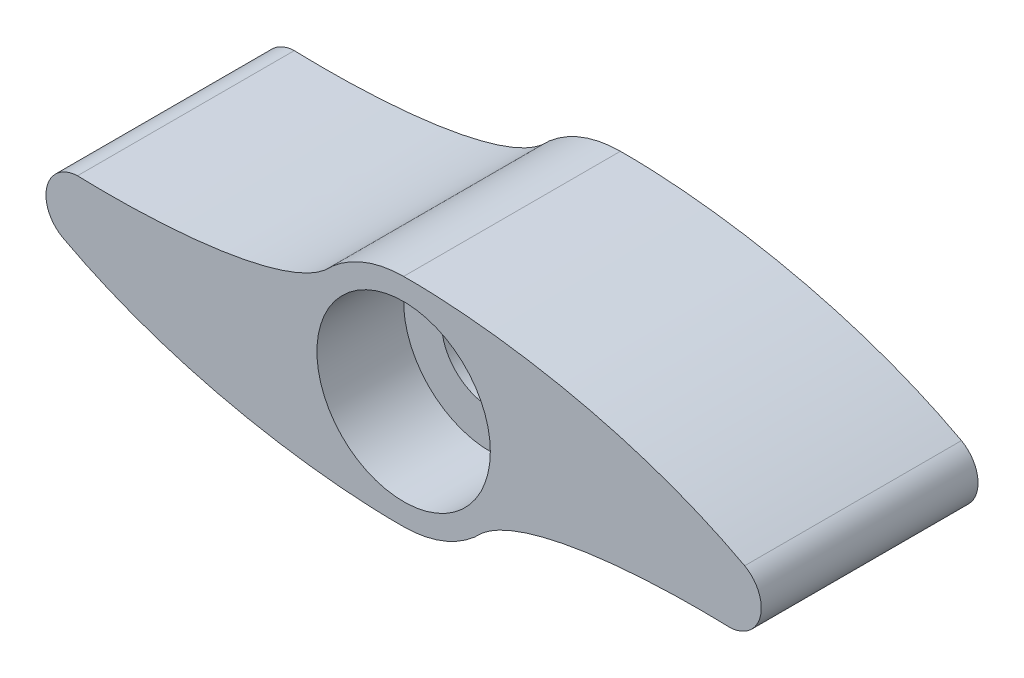
ISO-10303-21;
HEADER;
FILE_DESCRIPTION(('STEP AP214'),'2;1');
FILE_NAME('part.step','',(''),(''),'','','');
FILE_SCHEMA(('AUTOMOTIVE_DESIGN { 1 0 10303 214 1 1 1 1 }'));
ENDSEC;
DATA;
#1=APPLICATION_CONTEXT('core data for automotive mechanical design processes');
#2=APPLICATION_PROTOCOL_DEFINITION('international standard','automotive_design',2000,#1);
#3=PRODUCT_CONTEXT('',#1,'mechanical');
#4=PRODUCT('Part','Part','',(#3));
#5=PRODUCT_RELATED_PRODUCT_CATEGORY('part','',(#4));
#6=PRODUCT_DEFINITION_FORMATION('','',#4);
#7=PRODUCT_DEFINITION_CONTEXT('part definition',#1,'design');
#8=PRODUCT_DEFINITION('design','',#6,#7);
#9=PRODUCT_DEFINITION_SHAPE('','',#8);
#10=(LENGTH_UNIT() NAMED_UNIT(*) SI_UNIT(.MILLI.,.METRE.));
#11=(NAMED_UNIT(*) PLANE_ANGLE_UNIT() SI_UNIT($,.RADIAN.));
#12=(NAMED_UNIT(*) SI_UNIT($,.STERADIAN.) SOLID_ANGLE_UNIT());
#13=UNCERTAINTY_MEASURE_WITH_UNIT(LENGTH_MEASURE(1.E-05),#10,'distance_accuracy_value','');
#14=(GEOMETRIC_REPRESENTATION_CONTEXT(3) GLOBAL_UNCERTAINTY_ASSIGNED_CONTEXT((#13)) GLOBAL_UNIT_ASSIGNED_CONTEXT((#10,
#11,#12)) REPRESENTATION_CONTEXT('',''));
#15=CARTESIAN_POINT('',(0.,0.,0.));
#16=DIRECTION('',(0.,0.,1.));
#17=DIRECTION('',(1.,0.,0.));
#18=AXIS2_PLACEMENT_3D('',#15,#16,#17);
#19=CARTESIAN_POINT('',(-6.98119583788465,-4.30444399980492,10.));
#20=DIRECTION('',(0.,0.,-1.));
#21=DIRECTION('',(-1.,0.,0.));
#22=AXIS2_PLACEMENT_3D('',#19,#20,#21);
#23=PLANE('',#22);
#24=CARTESIAN_POINT('',(-15.7344248673067,-1.30790676819165,10.));
#25=CARTESIAN_POINT('',(-10.0867938176435,-4.33966719943678,10.));
#26=CARTESIAN_POINT('',(-3.28492012761338,-5.03621454397914,10.));
#27=CARTESIAN_POINT('',(0.,-5.,10.));
#28=B_SPLINE_CURVE_WITH_KNOTS('',3,(#24,#25,#26,#27),.UNSPECIFIED.,.F.,.F.,(4,4),(0.,1.),.UNSPECIFIED.);
#29=CARTESIAN_POINT('',(-15.7344248673067,-1.30790676819165,10.));
#30=VERTEX_POINT('',#29);
#31=CARTESIAN_POINT('',(0.,-5.,10.));
#32=VERTEX_POINT('',#31);
#33=EDGE_CURVE('E238',#30,#32,#28,.T.);
#34=ORIENTED_EDGE('',*,*,#33,.T.);
#35=CARTESIAN_POINT('',(0.,0.,10.));
#36=DIRECTION('',(0.,0.,1.));
#37=DIRECTION('',(1.,0.,0.));
#38=AXIS2_PLACEMENT_3D('',#35,#36,#37);
#39=CIRCLE('',#38,5.);
#40=CARTESIAN_POINT('',(3.6325228067604,-3.43580821035831,10.));
#41=VERTEX_POINT('',#40);
#42=EDGE_CURVE('E96',#32,#41,#39,.T.);
#43=ORIENTED_EDGE('',*,*,#42,.T.);
#44=CARTESIAN_POINT('',(3.6325228067604,-3.43580821035831,10.));
#45=CARTESIAN_POINT('',(5.45932540377512,-1.90210600197204,10.));
#46=CARTESIAN_POINT('',(10.3946412726031,-1.35543382633431,10.));
#47=CARTESIAN_POINT('',(15.0441418943268,-1.49935035704309,10.));
#48=B_SPLINE_CURVE_WITH_KNOTS('',3,(#44,#45,#46,#47),.UNSPECIFIED.,.F.,.F.,(4,4),(0.,1.),.UNSPECIFIED.);
#49=CARTESIAN_POINT('',(15.0441418943268,-1.4993503570431,10.));
#50=VERTEX_POINT('',#49);
#51=EDGE_CURVE('E162',#41,#50,#48,.T.);
#52=ORIENTED_EDGE('',*,*,#51,.T.);
#53=CARTESIAN_POINT('',(15.,0.,10.));
#54=DIRECTION('',(0.,0.,1.));
#55=DIRECTION('',(1.,0.,0.));
#56=AXIS2_PLACEMENT_3D('',#53,#54,#55);
#57=CIRCLE('',#56,1.5);
#58=CARTESIAN_POINT('',(15.7344248673067,1.30790676819165,10.));
#59=VERTEX_POINT('',#58);
#60=EDGE_CURVE('E157',#50,#59,#57,.T.);
#61=ORIENTED_EDGE('',*,*,#60,.T.);
#62=CARTESIAN_POINT('',(15.7344248673067,1.30790676819165,10.));
#63=CARTESIAN_POINT('',(10.0867938176435,4.33966719943678,10.));
#64=CARTESIAN_POINT('',(3.28492012761338,5.03621454397913,10.));
#65=CARTESIAN_POINT('',(0.,5.,10.));
#66=B_SPLINE_CURVE_WITH_KNOTS('',3,(#62,#63,#64,#65),.UNSPECIFIED.,.F.,.F.,(4,4),(0.,1.),.UNSPECIFIED.);
#67=CARTESIAN_POINT('',(0.,5.,10.));
#68=VERTEX_POINT('',#67);
#69=EDGE_CURVE('E115',#59,#68,#66,.T.);
#70=ORIENTED_EDGE('',*,*,#69,.T.);
#71=CARTESIAN_POINT('',(0.,0.,10.));
#72=DIRECTION('',(0.,0.,1.));
#73=DIRECTION('',(1.,0.,0.));
#74=AXIS2_PLACEMENT_3D('',#71,#72,#73);
#75=CIRCLE('',#74,5.);
#76=CARTESIAN_POINT('',(-3.6325228067604,3.43580821035831,10.));
#77=VERTEX_POINT('',#76);
#78=EDGE_CURVE('E109',#68,#77,#75,.T.);
#79=ORIENTED_EDGE('',*,*,#78,.T.);
#80=CARTESIAN_POINT('',(-3.6325228067604,3.43580821035831,10.));
#81=CARTESIAN_POINT('',(-5.45932540377512,1.90210600197204,10.));
#82=CARTESIAN_POINT('',(-10.3946412726031,1.35543382633431,10.));
#83=CARTESIAN_POINT('',(-15.0441418943268,1.49935035704309,10.));
#84=B_SPLINE_CURVE_WITH_KNOTS('',3,(#80,#81,#82,#83),.UNSPECIFIED.,.F.,.F.,(4,4),(0.,1.),.UNSPECIFIED.);
#85=CARTESIAN_POINT('',(-15.0441418943268,1.49935035704309,10.));
#86=VERTEX_POINT('',#85);
#87=EDGE_CURVE('E113',#77,#86,#84,.T.);
#88=ORIENTED_EDGE('',*,*,#87,.T.);
#89=CARTESIAN_POINT('',(-15.,0.,10.));
#90=DIRECTION('',(0.,0.,1.));
#91=DIRECTION('',(1.,0.,0.));
#92=AXIS2_PLACEMENT_3D('',#89,#90,#91);
#93=CIRCLE('',#92,1.5);
#94=EDGE_CURVE('E53',#86,#30,#93,.T.);
#95=ORIENTED_EDGE('',*,*,#94,.T.);
#96=EDGE_LOOP('',(#34,#43,#52,#61,#70,#79,#88,#95));
#97=FACE_BOUND('',#96,.T.);
#98=CARTESIAN_POINT('',(0.,0.,10.));
#99=DIRECTION('',(0.,0.,1.));
#100=DIRECTION('',(1.,0.,0.));
#101=AXIS2_PLACEMENT_3D('',#98,#99,#100);
#102=CIRCLE('',#101,3.99999999999999);
#103=CARTESIAN_POINT('',(3.99999999999999,0.,10.));
#104=VERTEX_POINT('',#103);
#105=EDGE_CURVE('E268',#104,#104,#102,.T.);
#106=ORIENTED_EDGE('',*,*,#105,.F.);
#107=EDGE_LOOP('',(#106));
#108=FACE_BOUND('',#107,.T.);
#109=ADVANCED_FACE('F35',(#97,#108),#23,.F.);
#110=DIRECTION('',(0.,0.,-1.));
#111=VECTOR('',#110,1.);
#112=SURFACE_OF_LINEAR_EXTRUSION('',#28,#111);
#113=CARTESIAN_POINT('',(-15.7344248673067,-1.30790676819165,0.));
#114=CARTESIAN_POINT('',(-10.0867938176435,-4.33966719943678,0.));
#115=CARTESIAN_POINT('',(-3.28492012761338,-5.03621454397914,0.));
#116=CARTESIAN_POINT('',(0.,-5.,0.));
#117=B_SPLINE_CURVE_WITH_KNOTS('',3,(#113,#114,#115,#116),.UNSPECIFIED.,.F.,.F.,(4,4),(0.,1.),.UNSPECIFIED.);
#118=CARTESIAN_POINT('',(-15.7344248673067,-1.30790676819165,0.));
#119=VERTEX_POINT('',#118);
#120=CARTESIAN_POINT('',(0.,-5.,0.));
#121=VERTEX_POINT('',#120);
#122=EDGE_CURVE('E201',#119,#121,#117,.T.);
#123=ORIENTED_EDGE('',*,*,#122,.T.);
#124=DIRECTION('',(0.,0.,-1.));
#125=VECTOR('',#124,1.);
#126=CARTESIAN_POINT('',(0.,-5.,10.));
#127=LINE('',#126,#125);
#128=EDGE_CURVE('E11',#32,#121,#127,.T.);
#129=ORIENTED_EDGE('',*,*,#128,.F.);
#130=ORIENTED_EDGE('',*,*,#33,.F.);
#131=DIRECTION('',(0.,0.,-1.));
#132=VECTOR('',#131,1.);
#133=CARTESIAN_POINT('',(-15.7344248673067,-1.30790676819165,10.));
#134=LINE('',#133,#132);
#135=EDGE_CURVE('E129',#30,#119,#134,.T.);
#136=ORIENTED_EDGE('',*,*,#135,.T.);
#137=EDGE_LOOP('',(#123,#129,#130,#136));
#138=FACE_BOUND('',#137,.T.);
#139=ADVANCED_FACE('F37',(#138),#112,.F.);
#140=CARTESIAN_POINT('',(0.,0.,10.));
#141=DIRECTION('',(0.,0.,-1.));
#142=DIRECTION('',(-1.,0.,0.));
#143=AXIS2_PLACEMENT_3D('',#140,#141,#142);
#144=CYLINDRICAL_SURFACE('',#143,5.);
#145=CARTESIAN_POINT('',(0.,0.,0.));
#146=DIRECTION('',(0.,0.,1.));
#147=DIRECTION('',(1.,0.,0.));
#148=AXIS2_PLACEMENT_3D('',#145,#146,#147);
#149=CIRCLE('',#148,5.);
#150=CARTESIAN_POINT('',(3.6325228067604,-3.43580821035831,0.));
#151=VERTEX_POINT('',#150);
#152=EDGE_CURVE('E203',#121,#151,#149,.T.);
#153=ORIENTED_EDGE('',*,*,#152,.T.);
#154=DIRECTION('',(0.,0.,-1.));
#155=VECTOR('',#154,1.);
#156=CARTESIAN_POINT('',(3.6325228067604,-3.43580821035831,10.));
#157=LINE('',#156,#155);
#158=EDGE_CURVE('E45',#41,#151,#157,.T.);
#159=ORIENTED_EDGE('',*,*,#158,.F.);
#160=ORIENTED_EDGE('',*,*,#42,.F.);
#161=ORIENTED_EDGE('',*,*,#128,.T.);
#162=EDGE_LOOP('',(#153,#159,#160,#161));
#163=FACE_BOUND('',#162,.T.);
#164=ADVANCED_FACE('F172',(#163),#144,.T.);
#165=DIRECTION('',(0.,0.,-1.));
#166=VECTOR('',#165,1.);
#167=SURFACE_OF_LINEAR_EXTRUSION('',#48,#166);
#168=CARTESIAN_POINT('',(3.6325228067604,-3.43580821035831,0.));
#169=CARTESIAN_POINT('',(5.45932540377512,-1.90210600197204,0.));
#170=CARTESIAN_POINT('',(10.3946412726031,-1.35543382633431,0.));
#171=CARTESIAN_POINT('',(15.0441418943268,-1.49935035704309,0.));
#172=B_SPLINE_CURVE_WITH_KNOTS('',3,(#168,#169,#170,#171),.UNSPECIFIED.,.F.,.F.,(4,4),(0.,1.),.UNSPECIFIED.);
#173=CARTESIAN_POINT('',(15.0441418943268,-1.4993503570431,0.));
#174=VERTEX_POINT('',#173);
#175=EDGE_CURVE('E205',#151,#174,#172,.T.);
#176=ORIENTED_EDGE('',*,*,#175,.T.);
#177=DIRECTION('',(0.,0.,-1.));
#178=VECTOR('',#177,1.);
#179=CARTESIAN_POINT('',(15.0441418943268,-1.4993503570431,10.));
#180=LINE('',#179,#178);
#181=EDGE_CURVE('E245',#50,#174,#180,.T.);
#182=ORIENTED_EDGE('',*,*,#181,.F.);
#183=ORIENTED_EDGE('',*,*,#51,.F.);
#184=ORIENTED_EDGE('',*,*,#158,.T.);
#185=EDGE_LOOP('',(#176,#182,#183,#184));
#186=FACE_BOUND('',#185,.T.);
#187=ADVANCED_FACE('F170',(#186),#167,.F.);
#188=CARTESIAN_POINT('',(15.,0.,10.));
#189=DIRECTION('',(0.,0.,-1.));
#190=DIRECTION('',(-1.,0.,0.));
#191=AXIS2_PLACEMENT_3D('',#188,#189,#190);
#192=CYLINDRICAL_SURFACE('',#191,1.5);
#193=CARTESIAN_POINT('',(15.,0.,0.));
#194=DIRECTION('',(0.,0.,1.));
#195=DIRECTION('',(1.,0.,0.));
#196=AXIS2_PLACEMENT_3D('',#193,#194,#195);
#197=CIRCLE('',#196,1.5);
#198=CARTESIAN_POINT('',(15.7344248673067,1.30790676819165,0.));
#199=VERTEX_POINT('',#198);
#200=EDGE_CURVE('E218',#174,#199,#197,.T.);
#201=ORIENTED_EDGE('',*,*,#200,.T.);
#202=DIRECTION('',(0.,0.,-1.));
#203=VECTOR('',#202,1.);
#204=CARTESIAN_POINT('',(15.7344248673067,1.30790676819165,10.));
#205=LINE('',#204,#203);
#206=EDGE_CURVE('E242',#59,#199,#205,.T.);
#207=ORIENTED_EDGE('',*,*,#206,.F.);
#208=ORIENTED_EDGE('',*,*,#60,.F.);
#209=ORIENTED_EDGE('',*,*,#181,.T.);
#210=EDGE_LOOP('',(#201,#207,#208,#209));
#211=FACE_BOUND('',#210,.T.);
#212=ADVANCED_FACE('F150',(#211),#192,.T.);
#213=DIRECTION('',(0.,0.,-1.));
#214=VECTOR('',#213,1.);
#215=SURFACE_OF_LINEAR_EXTRUSION('',#66,#214);
#216=CARTESIAN_POINT('',(15.7344248673067,1.30790676819165,0.));
#217=CARTESIAN_POINT('',(10.0867938176435,4.33966719943678,0.));
#218=CARTESIAN_POINT('',(3.28492012761338,5.03621454397913,0.));
#219=CARTESIAN_POINT('',(0.,5.,0.));
#220=B_SPLINE_CURVE_WITH_KNOTS('',3,(#216,#217,#218,#219),.UNSPECIFIED.,.F.,.F.,(4,4),(0.,1.),.UNSPECIFIED.);
#221=CARTESIAN_POINT('',(0.,5.,0.));
#222=VERTEX_POINT('',#221);
#223=EDGE_CURVE('E223',#199,#222,#220,.T.);
#224=ORIENTED_EDGE('',*,*,#223,.T.);
#225=DIRECTION('',(0.,0.,-1.));
#226=VECTOR('',#225,1.);
#227=CARTESIAN_POINT('',(0.,5.,10.));
#228=LINE('',#227,#226);
#229=EDGE_CURVE('E124',#68,#222,#228,.T.);
#230=ORIENTED_EDGE('',*,*,#229,.F.);
#231=ORIENTED_EDGE('',*,*,#69,.F.);
#232=ORIENTED_EDGE('',*,*,#206,.T.);
#233=EDGE_LOOP('',(#224,#230,#231,#232));
#234=FACE_BOUND('',#233,.T.);
#235=ADVANCED_FACE('F147',(#234),#215,.F.);
#236=CARTESIAN_POINT('',(0.,0.,10.));
#237=DIRECTION('',(0.,0.,-1.));
#238=DIRECTION('',(-1.,0.,0.));
#239=AXIS2_PLACEMENT_3D('',#236,#237,#238);
#240=CYLINDRICAL_SURFACE('',#239,5.);
#241=CARTESIAN_POINT('',(0.,0.,0.));
#242=DIRECTION('',(0.,0.,1.));
#243=DIRECTION('',(1.,0.,0.));
#244=AXIS2_PLACEMENT_3D('',#241,#242,#243);
#245=CIRCLE('',#244,5.);
#246=CARTESIAN_POINT('',(-3.6325228067604,3.43580821035831,0.));
#247=VERTEX_POINT('',#246);
#248=EDGE_CURVE('E123',#222,#247,#245,.T.);
#249=ORIENTED_EDGE('',*,*,#248,.T.);
#250=DIRECTION('',(0.,0.,-1.));
#251=VECTOR('',#250,1.);
#252=CARTESIAN_POINT('',(-3.6325228067604,3.43580821035831,10.));
#253=LINE('',#252,#251);
#254=EDGE_CURVE('E120',#77,#247,#253,.T.);
#255=ORIENTED_EDGE('',*,*,#254,.F.);
#256=ORIENTED_EDGE('',*,*,#78,.F.);
#257=ORIENTED_EDGE('',*,*,#229,.T.);
#258=EDGE_LOOP('',(#249,#255,#256,#257));
#259=FACE_BOUND('',#258,.T.);
#260=ADVANCED_FACE('F121',(#259),#240,.T.);
#261=DIRECTION('',(0.,0.,-1.));
#262=VECTOR('',#261,1.);
#263=SURFACE_OF_LINEAR_EXTRUSION('',#84,#262);
#264=CARTESIAN_POINT('',(-3.6325228067604,3.43580821035831,0.));
#265=CARTESIAN_POINT('',(-5.45932540377512,1.90210600197204,0.));
#266=CARTESIAN_POINT('',(-10.3946412726031,1.35543382633431,0.));
#267=CARTESIAN_POINT('',(-15.0441418943268,1.49935035704309,0.));
#268=B_SPLINE_CURVE_WITH_KNOTS('',3,(#264,#265,#266,#267),.UNSPECIFIED.,.F.,.F.,(4,4),(0.,1.),.UNSPECIFIED.);
#269=CARTESIAN_POINT('',(-15.0441418943268,1.49935035704309,0.));
#270=VERTEX_POINT('',#269);
#271=EDGE_CURVE('E82',#247,#270,#268,.T.);
#272=ORIENTED_EDGE('',*,*,#271,.T.);
#273=DIRECTION('',(0.,0.,-1.));
#274=VECTOR('',#273,1.);
#275=CARTESIAN_POINT('',(-15.0441418943268,1.49935035704309,10.));
#276=LINE('',#275,#274);
#277=EDGE_CURVE('E125',#86,#270,#276,.T.);
#278=ORIENTED_EDGE('',*,*,#277,.F.);
#279=ORIENTED_EDGE('',*,*,#87,.F.);
#280=ORIENTED_EDGE('',*,*,#254,.T.);
#281=EDGE_LOOP('',(#272,#278,#279,#280));
#282=FACE_BOUND('',#281,.T.);
#283=ADVANCED_FACE('F127',(#282),#263,.F.);
#284=CARTESIAN_POINT('',(-15.,0.,10.));
#285=DIRECTION('',(0.,0.,-1.));
#286=DIRECTION('',(-1.,0.,0.));
#287=AXIS2_PLACEMENT_3D('',#284,#285,#286);
#288=CYLINDRICAL_SURFACE('',#287,1.5);
#289=CARTESIAN_POINT('',(-15.,0.,0.));
#290=DIRECTION('',(0.,0.,1.));
#291=DIRECTION('',(1.,0.,0.));
#292=AXIS2_PLACEMENT_3D('',#289,#290,#291);
#293=CIRCLE('',#292,1.5);
#294=EDGE_CURVE('E88',#270,#119,#293,.T.);
#295=ORIENTED_EDGE('',*,*,#294,.T.);
#296=ORIENTED_EDGE('',*,*,#135,.F.);
#297=ORIENTED_EDGE('',*,*,#94,.F.);
#298=ORIENTED_EDGE('',*,*,#277,.T.);
#299=EDGE_LOOP('',(#295,#296,#297,#298));
#300=FACE_BOUND('',#299,.T.);
#301=ADVANCED_FACE('F143',(#300),#288,.T.);
#302=CARTESIAN_POINT('',(-6.98119583788465,-4.30444399980492,0.));
#303=DIRECTION('',(0.,0.,-1.));
#304=DIRECTION('',(-1.,0.,0.));
#305=AXIS2_PLACEMENT_3D('',#302,#303,#304);
#306=PLANE('',#305);
#307=CARTESIAN_POINT('',(0.,0.,0.));
#308=DIRECTION('',(0.,0.,1.));
#309=DIRECTION('',(1.,0.,0.));
#310=AXIS2_PLACEMENT_3D('',#307,#308,#309);
#311=CIRCLE('',#310,2.25000000000001);
#312=CARTESIAN_POINT('',(2.25000000000001,0.,0.));
#313=VERTEX_POINT('',#312);
#314=EDGE_CURVE('E198',#313,#313,#311,.T.);
#315=ORIENTED_EDGE('',*,*,#314,.T.);
#316=EDGE_LOOP('',(#315));
#317=FACE_BOUND('',#316,.T.);
#318=ORIENTED_EDGE('',*,*,#122,.F.);
#319=ORIENTED_EDGE('',*,*,#294,.F.);
#320=ORIENTED_EDGE('',*,*,#271,.F.);
#321=ORIENTED_EDGE('',*,*,#248,.F.);
#322=ORIENTED_EDGE('',*,*,#223,.F.);
#323=ORIENTED_EDGE('',*,*,#200,.F.);
#324=ORIENTED_EDGE('',*,*,#175,.F.);
#325=ORIENTED_EDGE('',*,*,#152,.F.);
#326=EDGE_LOOP('',(#318,#319,#320,#321,#322,#323,#324,#325));
#327=FACE_BOUND('',#326,.T.);
#328=ADVANCED_FACE('F186',(#317,#327),#306,.T.);
#329=CARTESIAN_POINT('',(0.,0.,10.));
#330=DIRECTION('',(0.,0.,1.));
#331=DIRECTION('',(1.,0.,0.));
#332=AXIS2_PLACEMENT_3D('',#329,#330,#331);
#333=CYLINDRICAL_SURFACE('',#332,2.25000000000001);
#334=ORIENTED_EDGE('',*,*,#314,.F.);
#335=EDGE_LOOP('',(#334));
#336=FACE_BOUND('',#335,.T.);
#337=CARTESIAN_POINT('',(0.,0.,6.));
#338=DIRECTION('',(0.,0.,1.));
#339=DIRECTION('',(1.,0.,0.));
#340=AXIS2_PLACEMENT_3D('',#337,#338,#339);
#341=CIRCLE('',#340,2.25000000000001);
#342=CARTESIAN_POINT('',(2.25000000000001,0.,6.));
#343=VERTEX_POINT('',#342);
#344=EDGE_CURVE('E207',#343,#343,#341,.T.);
#345=ORIENTED_EDGE('',*,*,#344,.T.);
#346=EDGE_LOOP('',(#345));
#347=FACE_BOUND('',#346,.T.);
#348=ADVANCED_FACE('F184',(#336,#347),#333,.F.);
#349=CARTESIAN_POINT('',(2.25000000000001,0.,6.));
#350=DIRECTION('',(0.,0.,-1.));
#351=DIRECTION('',(-1.,0.,0.));
#352=AXIS2_PLACEMENT_3D('',#349,#350,#351);
#353=PLANE('',#352);
#354=ORIENTED_EDGE('',*,*,#344,.F.);
#355=EDGE_LOOP('',(#354));
#356=FACE_BOUND('',#355,.T.);
#357=CARTESIAN_POINT('',(0.,0.,6.));
#358=DIRECTION('',(0.,0.,1.));
#359=DIRECTION('',(1.,0.,0.));
#360=AXIS2_PLACEMENT_3D('',#357,#358,#359);
#361=CIRCLE('',#360,3.99999999999999);
#362=CARTESIAN_POINT('',(3.99999999999999,0.,6.));
#363=VERTEX_POINT('',#362);
#364=EDGE_CURVE('E265',#363,#363,#361,.T.);
#365=ORIENTED_EDGE('',*,*,#364,.T.);
#366=EDGE_LOOP('',(#365));
#367=FACE_BOUND('',#366,.T.);
#368=ADVANCED_FACE('F193',(#356,#367),#353,.F.);
#369=CARTESIAN_POINT('',(0.,0.,10.));
#370=DIRECTION('',(0.,0.,1.));
#371=DIRECTION('',(1.,0.,0.));
#372=AXIS2_PLACEMENT_3D('',#369,#370,#371);
#373=CYLINDRICAL_SURFACE('',#372,3.99999999999999);
#374=ORIENTED_EDGE('',*,*,#364,.F.);
#375=EDGE_LOOP('',(#374));
#376=FACE_BOUND('',#375,.T.);
#377=ORIENTED_EDGE('',*,*,#105,.T.);
#378=EDGE_LOOP('',(#377));
#379=FACE_BOUND('',#378,.T.);
#380=ADVANCED_FACE('F272',(#376,#379),#373,.F.);
#381=CLOSED_SHELL('',(#109,#139,#164,#187,#212,#235,#260,#283,#301,#328,#348,#368,#380));
#382=MANIFOLD_SOLID_BREP('B2',#381);
#383=ADVANCED_BREP_SHAPE_REPRESENTATION('',(#18,#382),#14);
#384=SHAPE_DEFINITION_REPRESENTATION(#9,#383);
ENDSEC;
END-ISO-10303-21;
